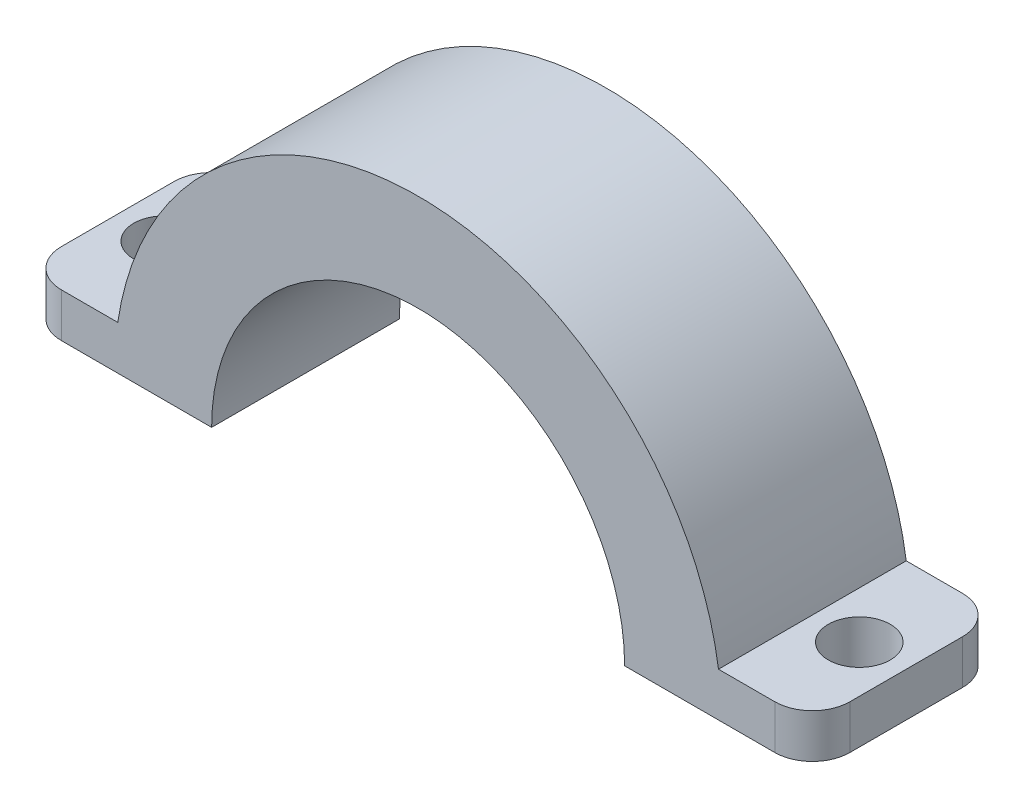
ISO-10303-21;
HEADER;
FILE_DESCRIPTION(('STEP AP214'),'2;1');
FILE_NAME('part.step','',(''),(''),'','','');
FILE_SCHEMA(('AUTOMOTIVE_DESIGN { 1 0 10303 214 1 1 1 1 }'));
ENDSEC;
DATA;
#1=APPLICATION_CONTEXT('core data for automotive mechanical design processes');
#2=APPLICATION_PROTOCOL_DEFINITION('international standard','automotive_design',2000,#1);
#3=PRODUCT_CONTEXT('',#1,'mechanical');
#4=PRODUCT('Part','Part','',(#3));
#5=PRODUCT_RELATED_PRODUCT_CATEGORY('part','',(#4));
#6=PRODUCT_DEFINITION_FORMATION('','',#4);
#7=PRODUCT_DEFINITION_CONTEXT('part definition',#1,'design');
#8=PRODUCT_DEFINITION('design','',#6,#7);
#9=PRODUCT_DEFINITION_SHAPE('','',#8);
#10=(LENGTH_UNIT() NAMED_UNIT(*) SI_UNIT(.MILLI.,.METRE.));
#11=(NAMED_UNIT(*) PLANE_ANGLE_UNIT() SI_UNIT($,.RADIAN.));
#12=(NAMED_UNIT(*) SI_UNIT($,.STERADIAN.) SOLID_ANGLE_UNIT());
#13=UNCERTAINTY_MEASURE_WITH_UNIT(LENGTH_MEASURE(1.E-05),#10,'distance_accuracy_value','');
#14=(GEOMETRIC_REPRESENTATION_CONTEXT(3) GLOBAL_UNCERTAINTY_ASSIGNED_CONTEXT((#13)) GLOBAL_UNIT_ASSIGNED_CONTEXT((#10,
#11,#12)) REPRESENTATION_CONTEXT('',''));
#15=CARTESIAN_POINT('',(0.,0.,0.));
#16=DIRECTION('',(0.,0.,1.));
#17=DIRECTION('',(1.,0.,0.));
#18=AXIS2_PLACEMENT_3D('',#15,#16,#17);
#19=CARTESIAN_POINT('',(0.,0.,10.));
#20=DIRECTION('',(0.,0.,-1.));
#21=DIRECTION('',(-1.,0.,0.));
#22=AXIS2_PLACEMENT_3D('',#19,#20,#21);
#23=CYLINDRICAL_SURFACE('',#22,11.);
#24=CARTESIAN_POINT('',(0.,0.,0.));
#25=DIRECTION('',(0.,0.,-1.));
#26=DIRECTION('',(-1.,0.,0.));
#27=AXIS2_PLACEMENT_3D('',#24,#25,#26);
#28=CIRCLE('',#27,11.);
#29=CARTESIAN_POINT('',(-11.,0.,0.));
#30=VERTEX_POINT('',#29);
#31=CARTESIAN_POINT('',(11.,0.,0.));
#32=VERTEX_POINT('',#31);
#33=EDGE_CURVE('E154',#30,#32,#28,.T.);
#34=ORIENTED_EDGE('',*,*,#33,.T.);
#35=DIRECTION('',(0.,0.,-1.));
#36=VECTOR('',#35,1.);
#37=CARTESIAN_POINT('',(11.,0.,10.));
#38=LINE('',#37,#36);
#39=CARTESIAN_POINT('',(11.,0.,10.));
#40=VERTEX_POINT('',#39);
#41=EDGE_CURVE('E134',#40,#32,#38,.T.);
#42=ORIENTED_EDGE('',*,*,#41,.F.);
#43=CARTESIAN_POINT('',(0.,0.,10.));
#44=DIRECTION('',(0.,0.,-1.));
#45=DIRECTION('',(-1.,0.,0.));
#46=AXIS2_PLACEMENT_3D('',#43,#44,#45);
#47=CIRCLE('',#46,11.);
#48=CARTESIAN_POINT('',(-11.,0.,10.));
#49=VERTEX_POINT('',#48);
#50=EDGE_CURVE('E141',#49,#40,#47,.T.);
#51=ORIENTED_EDGE('',*,*,#50,.F.);
#52=DIRECTION('',(0.,0.,-1.));
#53=VECTOR('',#52,1.);
#54=CARTESIAN_POINT('',(-11.,0.,10.));
#55=LINE('',#54,#53);
#56=EDGE_CURVE('E170',#49,#30,#55,.T.);
#57=ORIENTED_EDGE('',*,*,#56,.T.);
#58=EDGE_LOOP('',(#34,#42,#51,#57));
#59=FACE_BOUND('',#58,.T.);
#60=ADVANCED_FACE('F39',(#59),#23,.F.);
#61=CARTESIAN_POINT('',(0.,0.,10.));
#62=DIRECTION('',(0.,0.,-1.));
#63=DIRECTION('',(-1.,0.,0.));
#64=AXIS2_PLACEMENT_3D('',#61,#62,#63);
#65=CYLINDRICAL_SURFACE('',#64,16.1707474288067);
#66=CARTESIAN_POINT('',(0.,0.,0.));
#67=DIRECTION('',(0.,0.,1.));
#68=DIRECTION('',(-1.,0.,0.));
#69=AXIS2_PLACEMENT_3D('',#66,#67,#68);
#70=CIRCLE('',#69,16.1707474288067);
#71=CARTESIAN_POINT('',(16.,2.34373044658664,0.));
#72=VERTEX_POINT('',#71);
#73=CARTESIAN_POINT('',(-16.,2.34373044658664,0.));
#74=VERTEX_POINT('',#73);
#75=EDGE_CURVE('E172',#72,#74,#70,.T.);
#76=ORIENTED_EDGE('',*,*,#75,.T.);
#77=DIRECTION('',(0.,0.,-1.));
#78=VECTOR('',#77,1.);
#79=CARTESIAN_POINT('',(-16.,2.34373044658664,10.));
#80=LINE('',#79,#78);
#81=CARTESIAN_POINT('',(-16.,2.34373044658664,10.));
#82=VERTEX_POINT('',#81);
#83=EDGE_CURVE('E185',#82,#74,#80,.T.);
#84=ORIENTED_EDGE('',*,*,#83,.F.);
#85=CARTESIAN_POINT('',(0.,0.,10.));
#86=DIRECTION('',(0.,0.,1.));
#87=DIRECTION('',(-1.,0.,0.));
#88=AXIS2_PLACEMENT_3D('',#85,#86,#87);
#89=CIRCLE('',#88,16.1707474288067);
#90=CARTESIAN_POINT('',(16.,2.34373044658664,10.));
#91=VERTEX_POINT('',#90);
#92=EDGE_CURVE('E149',#91,#82,#89,.T.);
#93=ORIENTED_EDGE('',*,*,#92,.F.);
#94=DIRECTION('',(0.,0.,-1.));
#95=VECTOR('',#94,1.);
#96=CARTESIAN_POINT('',(16.,2.34373044658664,10.));
#97=LINE('',#96,#95);
#98=EDGE_CURVE('E237',#91,#72,#97,.T.);
#99=ORIENTED_EDGE('',*,*,#98,.T.);
#100=EDGE_LOOP('',(#76,#84,#93,#99));
#101=FACE_BOUND('',#100,.T.);
#102=ADVANCED_FACE('F262',(#101),#65,.T.);
#103=CARTESIAN_POINT('',(-16.,2.34373044658664,10.));
#104=DIRECTION('',(0.,-1.,0.));
#105=DIRECTION('',(1.,0.,0.));
#106=AXIS2_PLACEMENT_3D('',#103,#104,#105);
#107=PLANE('',#106);
#108=CARTESIAN_POINT('',(-18.5,2.34373044658664,5.));
#109=DIRECTION('',(0.,1.,0.));
#110=DIRECTION('',(-1.,0.,0.));
#111=AXIS2_PLACEMENT_3D('',#108,#109,#110);
#112=CIRCLE('',#111,1.65);
#113=CARTESIAN_POINT('',(-20.15,2.34373044658664,5.));
#114=VERTEX_POINT('',#113);
#115=EDGE_CURVE('E155',#114,#114,#112,.T.);
#116=ORIENTED_EDGE('',*,*,#115,.F.);
#117=EDGE_LOOP('',(#116));
#118=FACE_BOUND('',#117,.T.);
#119=DIRECTION('',(-1.,0.,0.));
#120=VECTOR('',#119,1.);
#121=CARTESIAN_POINT('',(-16.,2.34373044658664,0.));
#122=LINE('',#121,#120);
#123=CARTESIAN_POINT('',(-19.,2.34373044658664,0.));
#124=VERTEX_POINT('',#123);
#125=EDGE_CURVE('E174',#74,#124,#122,.T.);
#126=ORIENTED_EDGE('',*,*,#125,.T.);
#127=CARTESIAN_POINT('',(-19.,2.34373044658664,2.));
#128=DIRECTION('',(0.,-1.,0.));
#129=DIRECTION('',(1.,0.,0.));
#130=AXIS2_PLACEMENT_3D('',#127,#128,#129);
#131=CIRCLE('',#130,2.);
#132=CARTESIAN_POINT('',(-21.,2.34373044658664,2.));
#133=VERTEX_POINT('',#132);
#134=EDGE_CURVE('E203',#124,#133,#131,.F.);
#135=ORIENTED_EDGE('',*,*,#134,.T.);
#136=DIRECTION('',(0.,0.,-1.));
#137=VECTOR('',#136,1.);
#138=CARTESIAN_POINT('',(-21.,2.34373044658664,10.));
#139=LINE('',#138,#137);
#140=CARTESIAN_POINT('',(-21.,2.34373044658664,8.));
#141=VERTEX_POINT('',#140);
#142=EDGE_CURVE('E182',#141,#133,#139,.T.);
#143=ORIENTED_EDGE('',*,*,#142,.F.);
#144=CARTESIAN_POINT('',(-19.,2.34373044658664,8.));
#145=DIRECTION('',(0.,-1.,0.));
#146=DIRECTION('',(1.,0.,0.));
#147=AXIS2_PLACEMENT_3D('',#144,#145,#146);
#148=CIRCLE('',#147,2.);
#149=CARTESIAN_POINT('',(-19.,2.34373044658664,10.));
#150=VERTEX_POINT('',#149);
#151=EDGE_CURVE('E201',#141,#150,#148,.F.);
#152=ORIENTED_EDGE('',*,*,#151,.T.);
#153=DIRECTION('',(-1.,0.,0.));
#154=VECTOR('',#153,1.);
#155=CARTESIAN_POINT('',(-16.,2.34373044658664,10.));
#156=LINE('',#155,#154);
#157=EDGE_CURVE('E166',#82,#150,#156,.T.);
#158=ORIENTED_EDGE('',*,*,#157,.F.);
#159=ORIENTED_EDGE('',*,*,#83,.T.);
#160=EDGE_LOOP('',(#126,#135,#143,#152,#158,#159));
#161=FACE_BOUND('',#160,.T.);
#162=ADVANCED_FACE('F267',(#118,#161),#107,.F.);
#163=CARTESIAN_POINT('',(-21.,0.,10.));
#164=DIRECTION('',(1.,0.,0.));
#165=DIRECTION('',(0.,0.,-1.));
#166=AXIS2_PLACEMENT_3D('',#163,#164,#165);
#167=PLANE('',#166);
#168=ORIENTED_EDGE('',*,*,#142,.T.);
#169=DIRECTION('',(0.,-1.,0.));
#170=VECTOR('',#169,1.);
#171=CARTESIAN_POINT('',(-21.,0.,2.));
#172=LINE('',#171,#170);
#173=CARTESIAN_POINT('',(-21.,0.,2.));
#174=VERTEX_POINT('',#173);
#175=EDGE_CURVE('E192',#133,#174,#172,.T.);
#176=ORIENTED_EDGE('',*,*,#175,.T.);
#177=DIRECTION('',(0.,0.,-1.));
#178=VECTOR('',#177,1.);
#179=CARTESIAN_POINT('',(-21.,0.,10.));
#180=LINE('',#179,#178);
#181=CARTESIAN_POINT('',(-21.,0.,8.));
#182=VERTEX_POINT('',#181);
#183=EDGE_CURVE('E179',#182,#174,#180,.T.);
#184=ORIENTED_EDGE('',*,*,#183,.F.);
#185=DIRECTION('',(0.,-1.,0.));
#186=VECTOR('',#185,1.);
#187=CARTESIAN_POINT('',(-21.,0.,8.));
#188=LINE('',#187,#186);
#189=EDGE_CURVE('E188',#182,#141,#188,.F.);
#190=ORIENTED_EDGE('',*,*,#189,.T.);
#191=EDGE_LOOP('',(#168,#176,#184,#190));
#192=FACE_BOUND('',#191,.T.);
#193=ADVANCED_FACE('F296',(#192),#167,.F.);
#194=CARTESIAN_POINT('',(-21.,0.,10.));
#195=DIRECTION('',(0.,1.,0.));
#196=DIRECTION('',(-1.,0.,0.));
#197=AXIS2_PLACEMENT_3D('',#194,#195,#196);
#198=PLANE('',#197);
#199=CARTESIAN_POINT('',(-18.5,0.,5.));
#200=DIRECTION('',(0.,1.,0.));
#201=DIRECTION('',(-1.,0.,0.));
#202=AXIS2_PLACEMENT_3D('',#199,#200,#201);
#203=CIRCLE('',#202,1.65);
#204=CARTESIAN_POINT('',(-20.15,0.,5.));
#205=VERTEX_POINT('',#204);
#206=EDGE_CURVE('E159',#205,#205,#203,.T.);
#207=ORIENTED_EDGE('',*,*,#206,.T.);
#208=EDGE_LOOP('',(#207));
#209=FACE_BOUND('',#208,.T.);
#210=ORIENTED_EDGE('',*,*,#183,.T.);
#211=CARTESIAN_POINT('',(-19.,0.,2.));
#212=DIRECTION('',(0.,1.,0.));
#213=DIRECTION('',(-1.,0.,0.));
#214=AXIS2_PLACEMENT_3D('',#211,#212,#213);
#215=CIRCLE('',#214,2.);
#216=CARTESIAN_POINT('',(-19.,0.,0.));
#217=VERTEX_POINT('',#216);
#218=EDGE_CURVE('E197',#174,#217,#215,.F.);
#219=ORIENTED_EDGE('',*,*,#218,.T.);
#220=DIRECTION('',(1.,0.,0.));
#221=VECTOR('',#220,1.);
#222=CARTESIAN_POINT('',(-21.,0.,0.));
#223=LINE('',#222,#221);
#224=EDGE_CURVE('E150',#217,#30,#223,.T.);
#225=ORIENTED_EDGE('',*,*,#224,.T.);
#226=ORIENTED_EDGE('',*,*,#56,.F.);
#227=DIRECTION('',(1.,0.,0.));
#228=VECTOR('',#227,1.);
#229=CARTESIAN_POINT('',(-21.,0.,10.));
#230=LINE('',#229,#228);
#231=CARTESIAN_POINT('',(-19.,0.,10.));
#232=VERTEX_POINT('',#231);
#233=EDGE_CURVE('E145',#232,#49,#230,.T.);
#234=ORIENTED_EDGE('',*,*,#233,.F.);
#235=CARTESIAN_POINT('',(-19.,0.,8.));
#236=DIRECTION('',(0.,1.,0.));
#237=DIRECTION('',(-1.,0.,0.));
#238=AXIS2_PLACEMENT_3D('',#235,#236,#237);
#239=CIRCLE('',#238,2.);
#240=EDGE_CURVE('E195',#232,#182,#239,.F.);
#241=ORIENTED_EDGE('',*,*,#240,.T.);
#242=EDGE_LOOP('',(#210,#219,#225,#226,#234,#241));
#243=FACE_BOUND('',#242,.T.);
#244=ADVANCED_FACE('F299',(#209,#243),#198,.F.);
#245=CARTESIAN_POINT('',(0.,0.,10.));
#246=DIRECTION('',(0.,0.,-1.));
#247=DIRECTION('',(-1.,0.,0.));
#248=AXIS2_PLACEMENT_3D('',#245,#246,#247);
#249=PLANE('',#248);
#250=DIRECTION('',(-1.,0.,0.));
#251=VECTOR('',#250,1.);
#252=CARTESIAN_POINT('',(21.,0.,10.));
#253=LINE('',#252,#251);
#254=CARTESIAN_POINT('',(19.,0.,10.));
#255=VERTEX_POINT('',#254);
#256=EDGE_CURVE('E129',#255,#40,#253,.T.);
#257=ORIENTED_EDGE('',*,*,#256,.F.);
#258=DIRECTION('',(0.,-1.,0.));
#259=VECTOR('',#258,1.);
#260=CARTESIAN_POINT('',(19.,2.34373044658664,10.));
#261=LINE('',#260,#259);
#262=CARTESIAN_POINT('',(19.,2.34373044658664,10.));
#263=VERTEX_POINT('',#262);
#264=EDGE_CURVE('E11',#255,#263,#261,.F.);
#265=ORIENTED_EDGE('',*,*,#264,.T.);
#266=DIRECTION('',(1.,0.,0.));
#267=VECTOR('',#266,1.);
#268=CARTESIAN_POINT('',(16.,2.34373044658664,10.));
#269=LINE('',#268,#267);
#270=EDGE_CURVE('E137',#91,#263,#269,.T.);
#271=ORIENTED_EDGE('',*,*,#270,.F.);
#272=ORIENTED_EDGE('',*,*,#92,.T.);
#273=ORIENTED_EDGE('',*,*,#157,.T.);
#274=DIRECTION('',(0.,-1.,0.));
#275=VECTOR('',#274,1.);
#276=CARTESIAN_POINT('',(-19.,0.,10.));
#277=LINE('',#276,#275);
#278=EDGE_CURVE('E205',#150,#232,#277,.T.);
#279=ORIENTED_EDGE('',*,*,#278,.T.);
#280=ORIENTED_EDGE('',*,*,#233,.T.);
#281=ORIENTED_EDGE('',*,*,#50,.T.);
#282=EDGE_LOOP('',(#257,#265,#271,#272,#273,#279,#280,#281));
#283=FACE_BOUND('',#282,.T.);
#284=ADVANCED_FACE('F142',(#283),#249,.F.);
#285=CARTESIAN_POINT('',(0.,0.,0.));
#286=DIRECTION('',(0.,0.,-1.));
#287=DIRECTION('',(-1.,0.,0.));
#288=AXIS2_PLACEMENT_3D('',#285,#286,#287);
#289=PLANE('',#288);
#290=DIRECTION('',(1.,0.,0.));
#291=VECTOR('',#290,1.);
#292=CARTESIAN_POINT('',(16.,2.34373044658664,0.));
#293=LINE('',#292,#291);
#294=CARTESIAN_POINT('',(19.,2.34373044658664,0.));
#295=VERTEX_POINT('',#294);
#296=EDGE_CURVE('E138',#72,#295,#293,.T.);
#297=ORIENTED_EDGE('',*,*,#296,.T.);
#298=DIRECTION('',(0.,-1.,0.));
#299=VECTOR('',#298,1.);
#300=CARTESIAN_POINT('',(19.,0.,0.));
#301=LINE('',#300,#299);
#302=CARTESIAN_POINT('',(19.,0.,0.));
#303=VERTEX_POINT('',#302);
#304=EDGE_CURVE('E207',#295,#303,#301,.T.);
#305=ORIENTED_EDGE('',*,*,#304,.T.);
#306=DIRECTION('',(-1.,0.,0.));
#307=VECTOR('',#306,1.);
#308=CARTESIAN_POINT('',(21.,0.,0.));
#309=LINE('',#308,#307);
#310=EDGE_CURVE('E230',#303,#32,#309,.T.);
#311=ORIENTED_EDGE('',*,*,#310,.T.);
#312=ORIENTED_EDGE('',*,*,#33,.F.);
#313=ORIENTED_EDGE('',*,*,#224,.F.);
#314=DIRECTION('',(0.,-1.,0.));
#315=VECTOR('',#314,1.);
#316=CARTESIAN_POINT('',(-19.,2.34373044658664,0.));
#317=LINE('',#316,#315);
#318=EDGE_CURVE('E199',#217,#124,#317,.F.);
#319=ORIENTED_EDGE('',*,*,#318,.T.);
#320=ORIENTED_EDGE('',*,*,#125,.F.);
#321=ORIENTED_EDGE('',*,*,#75,.F.);
#322=EDGE_LOOP('',(#297,#305,#311,#312,#313,#319,#320,#321));
#323=FACE_BOUND('',#322,.T.);
#324=ADVANCED_FACE('F227',(#323),#289,.T.);
#325=CARTESIAN_POINT('',(-18.5,-7.65626955341336,5.));
#326=DIRECTION('',(0.,1.,0.));
#327=DIRECTION('',(-1.,0.,0.));
#328=AXIS2_PLACEMENT_3D('',#325,#326,#327);
#329=CYLINDRICAL_SURFACE('',#328,1.65);
#330=ORIENTED_EDGE('',*,*,#115,.T.);
#331=EDGE_LOOP('',(#330));
#332=FACE_BOUND('',#331,.T.);
#333=ORIENTED_EDGE('',*,*,#206,.F.);
#334=EDGE_LOOP('',(#333));
#335=FACE_BOUND('',#334,.T.);
#336=ADVANCED_FACE('F276',(#332,#335),#329,.F.);
#337=CARTESIAN_POINT('',(-19.,0.,2.));
#338=DIRECTION('',(0.,1.,0.));
#339=DIRECTION('',(0.,0.,1.));
#340=AXIS2_PLACEMENT_3D('',#337,#338,#339);
#341=CYLINDRICAL_SURFACE('',#340,2.);
#342=ORIENTED_EDGE('',*,*,#134,.F.);
#343=ORIENTED_EDGE('',*,*,#318,.F.);
#344=ORIENTED_EDGE('',*,*,#218,.F.);
#345=ORIENTED_EDGE('',*,*,#175,.F.);
#346=EDGE_LOOP('',(#342,#343,#344,#345));
#347=FACE_BOUND('',#346,.T.);
#348=ADVANCED_FACE('F272',(#347),#341,.T.);
#349=CARTESIAN_POINT('',(-19.,0.,8.));
#350=DIRECTION('',(0.,-1.,0.));
#351=DIRECTION('',(0.,0.,-1.));
#352=AXIS2_PLACEMENT_3D('',#349,#350,#351);
#353=CYLINDRICAL_SURFACE('',#352,2.);
#354=ORIENTED_EDGE('',*,*,#151,.F.);
#355=ORIENTED_EDGE('',*,*,#189,.F.);
#356=ORIENTED_EDGE('',*,*,#240,.F.);
#357=ORIENTED_EDGE('',*,*,#278,.F.);
#358=EDGE_LOOP('',(#354,#355,#356,#357));
#359=FACE_BOUND('',#358,.T.);
#360=ADVANCED_FACE('F275',(#359),#353,.T.);
#361=CARTESIAN_POINT('',(21.,0.,10.));
#362=DIRECTION('',(0.,-1.,0.));
#363=DIRECTION('',(1.,0.,0.));
#364=AXIS2_PLACEMENT_3D('',#361,#362,#363);
#365=PLANE('',#364);
#366=CARTESIAN_POINT('',(18.5,0.,5.));
#367=DIRECTION('',(0.,-1.,0.));
#368=DIRECTION('',(1.,0.,0.));
#369=AXIS2_PLACEMENT_3D('',#366,#367,#368);
#370=CIRCLE('',#369,1.65);
#371=CARTESIAN_POINT('',(20.15,0.,5.));
#372=VERTEX_POINT('',#371);
#373=EDGE_CURVE('E242',#372,#372,#370,.F.);
#374=ORIENTED_EDGE('',*,*,#373,.T.);
#375=EDGE_LOOP('',(#374));
#376=FACE_BOUND('',#375,.T.);
#377=ORIENTED_EDGE('',*,*,#310,.F.);
#378=CARTESIAN_POINT('',(19.,0.,2.));
#379=DIRECTION('',(0.,-1.,0.));
#380=DIRECTION('',(1.,0.,0.));
#381=AXIS2_PLACEMENT_3D('',#378,#379,#380);
#382=CIRCLE('',#381,2.);
#383=CARTESIAN_POINT('',(21.,0.,2.));
#384=VERTEX_POINT('',#383);
#385=EDGE_CURVE('E211',#303,#384,#382,.T.);
#386=ORIENTED_EDGE('',*,*,#385,.T.);
#387=DIRECTION('',(0.,0.,-1.));
#388=VECTOR('',#387,1.);
#389=CARTESIAN_POINT('',(21.,0.,10.));
#390=LINE('',#389,#388);
#391=CARTESIAN_POINT('',(21.,0.,8.));
#392=VERTEX_POINT('',#391);
#393=EDGE_CURVE('E156',#392,#384,#390,.T.);
#394=ORIENTED_EDGE('',*,*,#393,.F.);
#395=CARTESIAN_POINT('',(19.,0.,8.));
#396=DIRECTION('',(0.,-1.,0.));
#397=DIRECTION('',(1.,0.,0.));
#398=AXIS2_PLACEMENT_3D('',#395,#396,#397);
#399=CIRCLE('',#398,2.);
#400=EDGE_CURVE('E136',#392,#255,#399,.T.);
#401=ORIENTED_EDGE('',*,*,#400,.T.);
#402=ORIENTED_EDGE('',*,*,#256,.T.);
#403=ORIENTED_EDGE('',*,*,#41,.T.);
#404=EDGE_LOOP('',(#377,#386,#394,#401,#402,#403));
#405=FACE_BOUND('',#404,.T.);
#406=ADVANCED_FACE('F132',(#376,#405),#365,.T.);
#407=CARTESIAN_POINT('',(21.,0.,10.));
#408=DIRECTION('',(1.,0.,0.));
#409=DIRECTION('',(0.,0.,-1.));
#410=AXIS2_PLACEMENT_3D('',#407,#408,#409);
#411=PLANE('',#410);
#412=ORIENTED_EDGE('',*,*,#393,.T.);
#413=DIRECTION('',(0.,-1.,0.));
#414=VECTOR('',#413,1.);
#415=CARTESIAN_POINT('',(21.,0.,2.));
#416=LINE('',#415,#414);
#417=CARTESIAN_POINT('',(21.,2.34373044658664,2.));
#418=VERTEX_POINT('',#417);
#419=EDGE_CURVE('E60',#384,#418,#416,.F.);
#420=ORIENTED_EDGE('',*,*,#419,.T.);
#421=DIRECTION('',(0.,0.,-1.));
#422=VECTOR('',#421,1.);
#423=CARTESIAN_POINT('',(21.,2.34373044658664,10.));
#424=LINE('',#423,#422);
#425=CARTESIAN_POINT('',(21.,2.34373044658664,8.));
#426=VERTEX_POINT('',#425);
#427=EDGE_CURVE('E161',#426,#418,#424,.T.);
#428=ORIENTED_EDGE('',*,*,#427,.F.);
#429=DIRECTION('',(0.,-1.,0.));
#430=VECTOR('',#429,1.);
#431=CARTESIAN_POINT('',(21.,0.,8.));
#432=LINE('',#431,#430);
#433=EDGE_CURVE('E213',#426,#392,#432,.T.);
#434=ORIENTED_EDGE('',*,*,#433,.T.);
#435=EDGE_LOOP('',(#412,#420,#428,#434));
#436=FACE_BOUND('',#435,.T.);
#437=ADVANCED_FACE('F233',(#436),#411,.T.);
#438=CARTESIAN_POINT('',(16.,2.34373044658664,10.));
#439=DIRECTION('',(0.,1.,0.));
#440=DIRECTION('',(-1.,0.,0.));
#441=AXIS2_PLACEMENT_3D('',#438,#439,#440);
#442=PLANE('',#441);
#443=CARTESIAN_POINT('',(18.5,2.34373044658664,5.));
#444=DIRECTION('',(0.,-1.,0.));
#445=DIRECTION('',(1.,0.,0.));
#446=AXIS2_PLACEMENT_3D('',#443,#444,#445);
#447=CIRCLE('',#446,1.65);
#448=CARTESIAN_POINT('',(20.15,2.34373044658664,5.));
#449=VERTEX_POINT('',#448);
#450=EDGE_CURVE('E244',#449,#449,#447,.T.);
#451=ORIENTED_EDGE('',*,*,#450,.T.);
#452=EDGE_LOOP('',(#451));
#453=FACE_BOUND('',#452,.T.);
#454=ORIENTED_EDGE('',*,*,#427,.T.);
#455=CARTESIAN_POINT('',(19.,2.34373044658664,2.));
#456=DIRECTION('',(0.,1.,0.));
#457=DIRECTION('',(-1.,0.,0.));
#458=AXIS2_PLACEMENT_3D('',#455,#456,#457);
#459=CIRCLE('',#458,2.);
#460=EDGE_CURVE('E47',#418,#295,#459,.T.);
#461=ORIENTED_EDGE('',*,*,#460,.T.);
#462=ORIENTED_EDGE('',*,*,#296,.F.);
#463=ORIENTED_EDGE('',*,*,#98,.F.);
#464=ORIENTED_EDGE('',*,*,#270,.T.);
#465=CARTESIAN_POINT('',(19.,2.34373044658664,8.));
#466=DIRECTION('',(0.,1.,0.));
#467=DIRECTION('',(-1.,0.,0.));
#468=AXIS2_PLACEMENT_3D('',#465,#466,#467);
#469=CIRCLE('',#468,2.);
#470=EDGE_CURVE('E217',#263,#426,#469,.T.);
#471=ORIENTED_EDGE('',*,*,#470,.T.);
#472=EDGE_LOOP('',(#454,#461,#462,#463,#464,#471));
#473=FACE_BOUND('',#472,.T.);
#474=ADVANCED_FACE('F222',(#453,#473),#442,.T.);
#475=CARTESIAN_POINT('',(18.5,-7.65626955341336,5.));
#476=DIRECTION('',(0.,1.,0.));
#477=DIRECTION('',(-1.,0.,0.));
#478=AXIS2_PLACEMENT_3D('',#475,#476,#477);
#479=CYLINDRICAL_SURFACE('',#478,1.65);
#480=ORIENTED_EDGE('',*,*,#373,.F.);
#481=EDGE_LOOP('',(#480));
#482=FACE_BOUND('',#481,.T.);
#483=ORIENTED_EDGE('',*,*,#450,.F.);
#484=EDGE_LOOP('',(#483));
#485=FACE_BOUND('',#484,.T.);
#486=ADVANCED_FACE('F252',(#482,#485),#479,.F.);
#487=CARTESIAN_POINT('',(19.,0.,2.));
#488=DIRECTION('',(0.,-1.,0.));
#489=DIRECTION('',(0.,0.,-1.));
#490=AXIS2_PLACEMENT_3D('',#487,#488,#489);
#491=CYLINDRICAL_SURFACE('',#490,2.);
#492=ORIENTED_EDGE('',*,*,#460,.F.);
#493=ORIENTED_EDGE('',*,*,#419,.F.);
#494=ORIENTED_EDGE('',*,*,#385,.F.);
#495=ORIENTED_EDGE('',*,*,#304,.F.);
#496=EDGE_LOOP('',(#492,#493,#494,#495));
#497=FACE_BOUND('',#496,.T.);
#498=ADVANCED_FACE('F232',(#497),#491,.T.);
#499=CARTESIAN_POINT('',(19.,0.,8.));
#500=DIRECTION('',(0.,1.,0.));
#501=DIRECTION('',(0.,0.,1.));
#502=AXIS2_PLACEMENT_3D('',#499,#500,#501);
#503=CYLINDRICAL_SURFACE('',#502,2.);
#504=ORIENTED_EDGE('',*,*,#470,.F.);
#505=ORIENTED_EDGE('',*,*,#264,.F.);
#506=ORIENTED_EDGE('',*,*,#400,.F.);
#507=ORIENTED_EDGE('',*,*,#433,.F.);
#508=EDGE_LOOP('',(#504,#505,#506,#507));
#509=FACE_BOUND('',#508,.T.);
#510=ADVANCED_FACE('F41',(#509),#503,.T.);
#511=CLOSED_SHELL('',(#60,#102,#162,#193,#244,#284,#324,#336,#348,#360,#406,#437,#474,#486,#498,#510));
#512=MANIFOLD_SOLID_BREP('B2',#511);
#513=ADVANCED_BREP_SHAPE_REPRESENTATION('',(#18,#512),#14);
#514=SHAPE_DEFINITION_REPRESENTATION(#9,#513);
ENDSEC;
END-ISO-10303-21;
